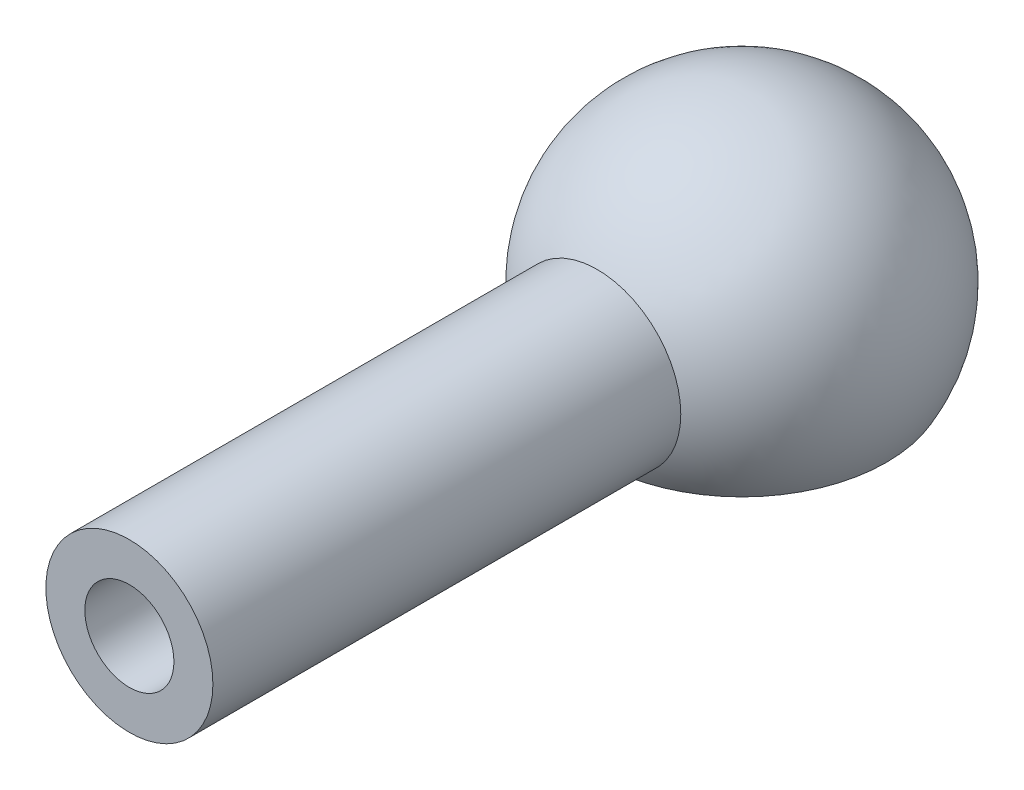
ISO-10303-21;
HEADER;
FILE_DESCRIPTION(('STEP AP214'),'2;1');
FILE_NAME('part.step','',(''),(''),'','','');
FILE_SCHEMA(('AUTOMOTIVE_DESIGN { 1 0 10303 214 1 1 1 1 }'));
ENDSEC;
DATA;
#1=APPLICATION_CONTEXT('core data for automotive mechanical design processes');
#2=APPLICATION_PROTOCOL_DEFINITION('international standard','automotive_design',2000,#1);
#3=PRODUCT_CONTEXT('',#1,'mechanical');
#4=PRODUCT('Part','Part','',(#3));
#5=PRODUCT_RELATED_PRODUCT_CATEGORY('part','',(#4));
#6=PRODUCT_DEFINITION_FORMATION('','',#4);
#7=PRODUCT_DEFINITION_CONTEXT('part definition',#1,'design');
#8=PRODUCT_DEFINITION('design','',#6,#7);
#9=PRODUCT_DEFINITION_SHAPE('','',#8);
#10=(LENGTH_UNIT() NAMED_UNIT(*) SI_UNIT(.MILLI.,.METRE.));
#11=(NAMED_UNIT(*) PLANE_ANGLE_UNIT() SI_UNIT($,.RADIAN.));
#12=(NAMED_UNIT(*) SI_UNIT($,.STERADIAN.) SOLID_ANGLE_UNIT());
#13=UNCERTAINTY_MEASURE_WITH_UNIT(LENGTH_MEASURE(1.E-05),#10,'distance_accuracy_value','');
#14=(GEOMETRIC_REPRESENTATION_CONTEXT(3) GLOBAL_UNCERTAINTY_ASSIGNED_CONTEXT((#13)) GLOBAL_UNIT_ASSIGNED_CONTEXT((#10,
#11,#12)) REPRESENTATION_CONTEXT('',''));
#15=CARTESIAN_POINT('',(0.,0.,0.));
#16=DIRECTION('',(0.,0.,1.));
#17=DIRECTION('',(1.,0.,0.));
#18=AXIS2_PLACEMENT_3D('',#15,#16,#17);
#19=CARTESIAN_POINT('',(0.,0.,0.));
#20=DIRECTION('',(0.,-1.,0.));
#21=DIRECTION('',(-1.,0.,0.));
#22=AXIS2_PLACEMENT_3D('',#19,#20,#21);
#23=SPHERICAL_SURFACE('',#22,3.75);
#24=CARTESIAN_POINT('',(0.,-1.87499999999999,0.));
#25=DIRECTION('',(0.,-1.,0.));
#26=DIRECTION('',(0.,0.,-1.));
#27=AXIS2_PLACEMENT_3D('',#24,#25,#26);
#28=CIRCLE('',#27,3.24759526419165);
#29=CARTESIAN_POINT('',(0.,-1.87499999999999,3.24759526419165));
#30=VERTEX_POINT('',#29);
#31=EDGE_CURVE('E11',#30,#30,#28,.T.);
#32=ORIENTED_EDGE('',*,*,#31,.F.);
#33=CARTESIAN_POINT('',(0.,0.,3.24759526419165));
#34=DIRECTION('',(0.,0.,-1.));
#35=DIRECTION('',(-1.,0.,0.));
#36=AXIS2_PLACEMENT_3D('',#33,#34,#35);
#37=CIRCLE('',#36,1.87499999999999);
#38=EDGE_CURVE('E46',#30,#30,#37,.F.);
#39=ORIENTED_EDGE('',*,*,#38,.F.);
#40=EDGE_LOOP('',(#32,#39));
#41=FACE_BOUND('',#40,.T.);
#42=ADVANCED_FACE('F36',(#41),#23,.T.);
#43=CARTESIAN_POINT('',(0.,-1.87499999999999,0.));
#44=DIRECTION('',(0.,-1.,0.));
#45=DIRECTION('',(0.,0.,-1.));
#46=AXIS2_PLACEMENT_3D('',#43,#44,#45);
#47=CONICAL_SURFACE('',#46,3.24759526419165,1.0471975511966);
#48=CARTESIAN_POINT('',(0.,-1.25,0.));
#49=DIRECTION('',(0.,-1.,0.));
#50=DIRECTION('',(0.,0.,-1.));
#51=AXIS2_PLACEMENT_3D('',#48,#49,#50);
#52=CIRCLE('',#51,2.1650635094611);
#53=CARTESIAN_POINT('',(0.,-1.25,-2.1650635094611));
#54=VERTEX_POINT('',#53);
#55=EDGE_CURVE('E42',#54,#54,#52,.T.);
#56=ORIENTED_EDGE('',*,*,#55,.F.);
#57=EDGE_LOOP('',(#56));
#58=FACE_BOUND('',#57,.T.);
#59=ORIENTED_EDGE('',*,*,#31,.T.);
#60=EDGE_LOOP('',(#59));
#61=FACE_BOUND('',#60,.T.);
#62=ADVANCED_FACE('F83',(#58,#61),#47,.F.);
#63=CARTESIAN_POINT('',(0.,0.,0.));
#64=DIRECTION('',(0.,-1.,0.));
#65=DIRECTION('',(-1.,0.,0.));
#66=AXIS2_PLACEMENT_3D('',#63,#64,#65);
#67=SPHERICAL_SURFACE('',#66,2.5);
#68=ORIENTED_EDGE('',*,*,#55,.T.);
#69=EDGE_LOOP('',(#68));
#70=FACE_BOUND('',#69,.T.);
#71=ADVANCED_FACE('F78',(#70),#67,.F.);
#72=CARTESIAN_POINT('',(0.,0.,-3.752));
#73=DIRECTION('',(0.,0.,1.));
#74=DIRECTION('',(1.,0.,0.));
#75=AXIS2_PLACEMENT_3D('',#72,#73,#74);
#76=CYLINDRICAL_SURFACE('',#75,1.87499999999999);
#77=ORIENTED_EDGE('',*,*,#38,.T.);
#78=EDGE_LOOP('',(#77));
#79=FACE_BOUND('',#78,.T.);
#80=CARTESIAN_POINT('',(0.,0.,13.75));
#81=DIRECTION('',(0.,0.,1.));
#82=DIRECTION('',(1.,0.,0.));
#83=AXIS2_PLACEMENT_3D('',#80,#81,#82);
#84=CIRCLE('',#83,1.87499999999999);
#85=CARTESIAN_POINT('',(1.87499999999999,0.,13.75));
#86=VERTEX_POINT('',#85);
#87=EDGE_CURVE('E51',#86,#86,#84,.T.);
#88=ORIENTED_EDGE('',*,*,#87,.F.);
#89=EDGE_LOOP('',(#88));
#90=FACE_BOUND('',#89,.T.);
#91=ADVANCED_FACE('F47',(#79,#90),#76,.T.);
#92=CARTESIAN_POINT('',(0.,0.,13.75));
#93=DIRECTION('',(0.,0.,1.));
#94=DIRECTION('',(1.,0.,0.));
#95=AXIS2_PLACEMENT_3D('',#92,#93,#94);
#96=PLANE('',#95);
#97=CARTESIAN_POINT('',(0.,0.,13.75));
#98=DIRECTION('',(0.,0.,1.));
#99=DIRECTION('',(1.,0.,0.));
#100=AXIS2_PLACEMENT_3D('',#97,#98,#99);
#101=CIRCLE('',#100,1.);
#102=CARTESIAN_POINT('',(1.,0.,13.75));
#103=VERTEX_POINT('',#102);
#104=EDGE_CURVE('E58',#103,#103,#101,.T.);
#105=ORIENTED_EDGE('',*,*,#104,.F.);
#106=EDGE_LOOP('',(#105));
#107=FACE_BOUND('',#106,.T.);
#108=ORIENTED_EDGE('',*,*,#87,.T.);
#109=EDGE_LOOP('',(#108));
#110=FACE_BOUND('',#109,.T.);
#111=ADVANCED_FACE('F69',(#107,#110),#96,.T.);
#112=CARTESIAN_POINT('',(0.,0.,3.75));
#113=DIRECTION('',(0.,0.,1.));
#114=DIRECTION('',(1.,0.,0.));
#115=AXIS2_PLACEMENT_3D('',#112,#113,#114);
#116=CYLINDRICAL_SURFACE('',#115,1.);
#117=CARTESIAN_POINT('',(0.,0.,3.75));
#118=DIRECTION('',(0.,0.,1.));
#119=DIRECTION('',(1.,0.,0.));
#120=AXIS2_PLACEMENT_3D('',#117,#118,#119);
#121=CIRCLE('',#120,1.);
#122=CARTESIAN_POINT('',(1.,0.,3.75));
#123=VERTEX_POINT('',#122);
#124=EDGE_CURVE('E55',#123,#123,#121,.T.);
#125=ORIENTED_EDGE('',*,*,#124,.F.);
#126=EDGE_LOOP('',(#125));
#127=FACE_BOUND('',#126,.T.);
#128=ORIENTED_EDGE('',*,*,#104,.T.);
#129=EDGE_LOOP('',(#128));
#130=FACE_BOUND('',#129,.T.);
#131=ADVANCED_FACE('F66',(#127,#130),#116,.F.);
#132=CARTESIAN_POINT('',(0.,0.,3.75));
#133=DIRECTION('',(0.,0.,1.));
#134=DIRECTION('',(1.,0.,0.));
#135=AXIS2_PLACEMENT_3D('',#132,#133,#134);
#136=PLANE('',#135);
#137=ORIENTED_EDGE('',*,*,#124,.T.);
#138=EDGE_LOOP('',(#137));
#139=FACE_BOUND('',#138,.T.);
#140=ADVANCED_FACE('F64',(#139),#136,.T.);
#141=CLOSED_SHELL('',(#42,#62,#71,#91,#111,#131,#140));
#142=MANIFOLD_SOLID_BREP('B2',#141);
#143=ADVANCED_BREP_SHAPE_REPRESENTATION('',(#18,#142),#14);
#144=SHAPE_DEFINITION_REPRESENTATION(#9,#143);
ENDSEC;
END-ISO-10303-21;
